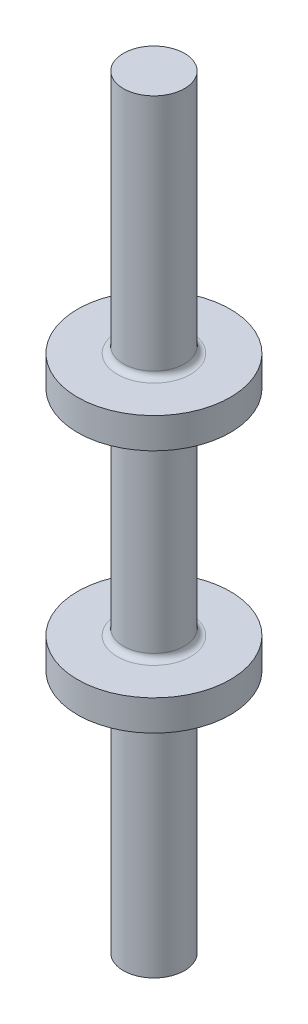
ISO-10303-21;
HEADER;
FILE_DESCRIPTION(('STEP AP214'),'2;1');
FILE_NAME('part.step','',(''),(''),'','','');
FILE_SCHEMA(('AUTOMOTIVE_DESIGN { 1 0 10303 214 1 1 1 1 }'));
ENDSEC;
DATA;
#1=APPLICATION_CONTEXT('core data for automotive mechanical design processes');
#2=APPLICATION_PROTOCOL_DEFINITION('international standard','automotive_design',2000,#1);
#3=PRODUCT_CONTEXT('',#1,'mechanical');
#4=PRODUCT('Part','Part','',(#3));
#5=PRODUCT_RELATED_PRODUCT_CATEGORY('part','',(#4));
#6=PRODUCT_DEFINITION_FORMATION('','',#4);
#7=PRODUCT_DEFINITION_CONTEXT('part definition',#1,'design');
#8=PRODUCT_DEFINITION('design','',#6,#7);
#9=PRODUCT_DEFINITION_SHAPE('','',#8);
#10=(LENGTH_UNIT() NAMED_UNIT(*) SI_UNIT(.MILLI.,.METRE.));
#11=(NAMED_UNIT(*) PLANE_ANGLE_UNIT() SI_UNIT($,.RADIAN.));
#12=(NAMED_UNIT(*) SI_UNIT($,.STERADIAN.) SOLID_ANGLE_UNIT());
#13=UNCERTAINTY_MEASURE_WITH_UNIT(LENGTH_MEASURE(1.E-05),#10,'distance_accuracy_value','');
#14=(GEOMETRIC_REPRESENTATION_CONTEXT(3) GLOBAL_UNCERTAINTY_ASSIGNED_CONTEXT((#13)) GLOBAL_UNIT_ASSIGNED_CONTEXT((#10,
#11,#12)) REPRESENTATION_CONTEXT('',''));
#15=CARTESIAN_POINT('',(0.,0.,0.));
#16=DIRECTION('',(0.,0.,1.));
#17=DIRECTION('',(1.,0.,0.));
#18=AXIS2_PLACEMENT_3D('',#15,#16,#17);
#19=CARTESIAN_POINT('',(0.,0.,0.));
#20=DIRECTION('',(0.,1.,0.));
#21=DIRECTION('',(0.,0.,1.));
#22=AXIS2_PLACEMENT_3D('',#19,#20,#21);
#23=PLANE('',#22);
#24=CARTESIAN_POINT('',(0.,0.,0.));
#25=DIRECTION('',(0.,1.,0.));
#26=DIRECTION('',(0.,0.,1.));
#27=AXIS2_PLACEMENT_3D('',#24,#25,#26);
#28=CIRCLE('',#27,1.);
#29=CARTESIAN_POINT('',(0.,0.,1.));
#30=VERTEX_POINT('',#29);
#31=EDGE_CURVE('E80',#30,#30,#28,.T.);
#32=ORIENTED_EDGE('',*,*,#31,.F.);
#33=EDGE_LOOP('',(#32));
#34=FACE_BOUND('',#33,.T.);
#35=ADVANCED_FACE('F38',(#34),#23,.F.);
#36=CARTESIAN_POINT('',(0.,25.,0.));
#37=DIRECTION('',(0.,1.,0.));
#38=DIRECTION('',(0.,0.,1.));
#39=AXIS2_PLACEMENT_3D('',#36,#37,#38);
#40=CYLINDRICAL_SURFACE('',#39,1.);
#41=CARTESIAN_POINT('',(0.,7.8,0.));
#42=DIRECTION('',(0.,1.,0.));
#43=DIRECTION('',(0.,0.,1.));
#44=AXIS2_PLACEMENT_3D('',#41,#42,#43);
#45=CIRCLE('',#44,1.);
#46=CARTESIAN_POINT('',(0.,7.8,1.));
#47=VERTEX_POINT('',#46);
#48=EDGE_CURVE('E72',#47,#47,#45,.F.);
#49=ORIENTED_EDGE('',*,*,#48,.T.);
#50=EDGE_LOOP('',(#49));
#51=FACE_BOUND('',#50,.T.);
#52=ORIENTED_EDGE('',*,*,#31,.T.);
#53=EDGE_LOOP('',(#52));
#54=FACE_BOUND('',#53,.T.);
#55=ADVANCED_FACE('F121',(#51,#54),#40,.T.);
#56=CARTESIAN_POINT('',(1.,8.,0.));
#57=DIRECTION('',(0.,1.,0.));
#58=DIRECTION('',(0.,0.,1.));
#59=AXIS2_PLACEMENT_3D('',#56,#57,#58);
#60=PLANE('',#59);
#61=CARTESIAN_POINT('',(0.,8.,0.));
#62=DIRECTION('',(0.,1.,0.));
#63=DIRECTION('',(0.,0.,1.));
#64=AXIS2_PLACEMENT_3D('',#61,#62,#63);
#65=CIRCLE('',#64,1.2);
#66=CARTESIAN_POINT('',(0.,8.,1.2));
#67=VERTEX_POINT('',#66);
#68=EDGE_CURVE('E76',#67,#67,#65,.T.);
#69=ORIENTED_EDGE('',*,*,#68,.T.);
#70=EDGE_LOOP('',(#69));
#71=FACE_BOUND('',#70,.T.);
#72=CARTESIAN_POINT('',(0.,8.,0.));
#73=DIRECTION('',(0.,1.,0.));
#74=DIRECTION('',(0.,0.,1.));
#75=AXIS2_PLACEMENT_3D('',#72,#73,#74);
#76=CIRCLE('',#75,2.5);
#77=CARTESIAN_POINT('',(0.,8.,2.5));
#78=VERTEX_POINT('',#77);
#79=EDGE_CURVE('E84',#78,#78,#76,.T.);
#80=ORIENTED_EDGE('',*,*,#79,.F.);
#81=EDGE_LOOP('',(#80));
#82=FACE_BOUND('',#81,.T.);
#83=ADVANCED_FACE('F127',(#71,#82),#60,.F.);
#84=CARTESIAN_POINT('',(0.,25.,0.));
#85=DIRECTION('',(0.,1.,0.));
#86=DIRECTION('',(0.,0.,1.));
#87=AXIS2_PLACEMENT_3D('',#84,#85,#86);
#88=CYLINDRICAL_SURFACE('',#87,2.5);
#89=CARTESIAN_POINT('',(0.,9.,0.));
#90=DIRECTION('',(0.,1.,0.));
#91=DIRECTION('',(0.,0.,1.));
#92=AXIS2_PLACEMENT_3D('',#89,#90,#91);
#93=CIRCLE('',#92,2.5);
#94=CARTESIAN_POINT('',(0.,9.,2.5));
#95=VERTEX_POINT('',#94);
#96=EDGE_CURVE('E88',#95,#95,#93,.T.);
#97=ORIENTED_EDGE('',*,*,#96,.F.);
#98=EDGE_LOOP('',(#97));
#99=FACE_BOUND('',#98,.T.);
#100=ORIENTED_EDGE('',*,*,#79,.T.);
#101=EDGE_LOOP('',(#100));
#102=FACE_BOUND('',#101,.T.);
#103=ADVANCED_FACE('F170',(#99,#102),#88,.T.);
#104=CARTESIAN_POINT('',(2.5,9.,0.));
#105=DIRECTION('',(0.,-1.,0.));
#106=DIRECTION('',(0.,0.,-1.));
#107=AXIS2_PLACEMENT_3D('',#104,#105,#106);
#108=PLANE('',#107);
#109=CARTESIAN_POINT('',(0.,9.,0.));
#110=DIRECTION('',(0.,-1.,0.));
#111=DIRECTION('',(0.,0.,-1.));
#112=AXIS2_PLACEMENT_3D('',#109,#110,#111);
#113=CIRCLE('',#112,1.2);
#114=CARTESIAN_POINT('',(0.,9.,-1.2));
#115=VERTEX_POINT('',#114);
#116=EDGE_CURVE('E58',#115,#115,#113,.T.);
#117=ORIENTED_EDGE('',*,*,#116,.T.);
#118=EDGE_LOOP('',(#117));
#119=FACE_BOUND('',#118,.T.);
#120=ORIENTED_EDGE('',*,*,#96,.T.);
#121=EDGE_LOOP('',(#120));
#122=FACE_BOUND('',#121,.T.);
#123=ADVANCED_FACE('F166',(#119,#122),#108,.F.);
#124=CARTESIAN_POINT('',(0.,25.,0.));
#125=DIRECTION('',(0.,1.,0.));
#126=DIRECTION('',(0.,0.,1.));
#127=AXIS2_PLACEMENT_3D('',#124,#125,#126);
#128=CYLINDRICAL_SURFACE('',#127,1.);
#129=CARTESIAN_POINT('',(0.,9.2,0.));
#130=DIRECTION('',(0.,-1.,0.));
#131=DIRECTION('',(0.,0.,-1.));
#132=AXIS2_PLACEMENT_3D('',#129,#130,#131);
#133=CIRCLE('',#132,1.);
#134=CARTESIAN_POINT('',(0.,9.2,-1.));
#135=VERTEX_POINT('',#134);
#136=EDGE_CURVE('E64',#135,#135,#133,.F.);
#137=ORIENTED_EDGE('',*,*,#136,.T.);
#138=EDGE_LOOP('',(#137));
#139=FACE_BOUND('',#138,.T.);
#140=CARTESIAN_POINT('',(0.,15.8,0.));
#141=DIRECTION('',(0.,1.,0.));
#142=DIRECTION('',(0.,0.,1.));
#143=AXIS2_PLACEMENT_3D('',#140,#141,#142);
#144=CIRCLE('',#143,1.);
#145=CARTESIAN_POINT('',(0.,15.8,1.));
#146=VERTEX_POINT('',#145);
#147=EDGE_CURVE('E68',#146,#146,#144,.F.);
#148=ORIENTED_EDGE('',*,*,#147,.T.);
#149=EDGE_LOOP('',(#148));
#150=FACE_BOUND('',#149,.T.);
#151=ADVANCED_FACE('F153',(#139,#150),#128,.T.);
#152=CARTESIAN_POINT('',(1.,16.,0.));
#153=DIRECTION('',(0.,1.,0.));
#154=DIRECTION('',(0.,0.,1.));
#155=AXIS2_PLACEMENT_3D('',#152,#153,#154);
#156=PLANE('',#155);
#157=CARTESIAN_POINT('',(0.,16.,0.));
#158=DIRECTION('',(0.,1.,0.));
#159=DIRECTION('',(0.,0.,1.));
#160=AXIS2_PLACEMENT_3D('',#157,#158,#159);
#161=CIRCLE('',#160,1.2);
#162=CARTESIAN_POINT('',(0.,16.,1.2));
#163=VERTEX_POINT('',#162);
#164=EDGE_CURVE('E52',#163,#163,#161,.T.);
#165=ORIENTED_EDGE('',*,*,#164,.T.);
#166=EDGE_LOOP('',(#165));
#167=FACE_BOUND('',#166,.T.);
#168=CARTESIAN_POINT('',(0.,16.,0.));
#169=DIRECTION('',(0.,1.,0.));
#170=DIRECTION('',(0.,0.,1.));
#171=AXIS2_PLACEMENT_3D('',#168,#169,#170);
#172=CIRCLE('',#171,2.5);
#173=CARTESIAN_POINT('',(0.,16.,2.5));
#174=VERTEX_POINT('',#173);
#175=EDGE_CURVE('E92',#174,#174,#172,.T.);
#176=ORIENTED_EDGE('',*,*,#175,.F.);
#177=EDGE_LOOP('',(#176));
#178=FACE_BOUND('',#177,.T.);
#179=ADVANCED_FACE('F150',(#167,#178),#156,.F.);
#180=CARTESIAN_POINT('',(0.,25.,0.));
#181=DIRECTION('',(0.,1.,0.));
#182=DIRECTION('',(0.,0.,1.));
#183=AXIS2_PLACEMENT_3D('',#180,#181,#182);
#184=CYLINDRICAL_SURFACE('',#183,2.5);
#185=CARTESIAN_POINT('',(0.,17.,0.));
#186=DIRECTION('',(0.,1.,0.));
#187=DIRECTION('',(0.,0.,1.));
#188=AXIS2_PLACEMENT_3D('',#185,#186,#187);
#189=CIRCLE('',#188,2.5);
#190=CARTESIAN_POINT('',(0.,17.,2.5));
#191=VERTEX_POINT('',#190);
#192=EDGE_CURVE('E96',#191,#191,#189,.T.);
#193=ORIENTED_EDGE('',*,*,#192,.F.);
#194=EDGE_LOOP('',(#193));
#195=FACE_BOUND('',#194,.T.);
#196=ORIENTED_EDGE('',*,*,#175,.T.);
#197=EDGE_LOOP('',(#196));
#198=FACE_BOUND('',#197,.T.);
#199=ADVANCED_FACE('F118',(#195,#198),#184,.T.);
#200=CARTESIAN_POINT('',(2.5,17.,0.));
#201=DIRECTION('',(0.,-1.,0.));
#202=DIRECTION('',(0.,0.,-1.));
#203=AXIS2_PLACEMENT_3D('',#200,#201,#202);
#204=PLANE('',#203);
#205=CARTESIAN_POINT('',(0.,17.,0.));
#206=DIRECTION('',(0.,-1.,0.));
#207=DIRECTION('',(0.,0.,-1.));
#208=AXIS2_PLACEMENT_3D('',#205,#206,#207);
#209=CIRCLE('',#208,1.2);
#210=CARTESIAN_POINT('',(0.,17.,-1.2));
#211=VERTEX_POINT('',#210);
#212=EDGE_CURVE('E10',#211,#211,#209,.T.);
#213=ORIENTED_EDGE('',*,*,#212,.T.);
#214=EDGE_LOOP('',(#213));
#215=FACE_BOUND('',#214,.T.);
#216=ORIENTED_EDGE('',*,*,#192,.T.);
#217=EDGE_LOOP('',(#216));
#218=FACE_BOUND('',#217,.T.);
#219=ADVANCED_FACE('F110',(#215,#218),#204,.F.);
#220=CARTESIAN_POINT('',(0.,25.,0.));
#221=DIRECTION('',(0.,1.,0.));
#222=DIRECTION('',(0.,0.,1.));
#223=AXIS2_PLACEMENT_3D('',#220,#221,#222);
#224=CYLINDRICAL_SURFACE('',#223,1.);
#225=CARTESIAN_POINT('',(0.,17.2,0.));
#226=DIRECTION('',(0.,-1.,0.));
#227=DIRECTION('',(0.,0.,-1.));
#228=AXIS2_PLACEMENT_3D('',#225,#226,#227);
#229=CIRCLE('',#228,1.);
#230=CARTESIAN_POINT('',(0.,17.2,-1.));
#231=VERTEX_POINT('',#230);
#232=EDGE_CURVE('E46',#231,#231,#229,.F.);
#233=ORIENTED_EDGE('',*,*,#232,.T.);
#234=EDGE_LOOP('',(#233));
#235=FACE_BOUND('',#234,.T.);
#236=CARTESIAN_POINT('',(0.,25.,0.));
#237=DIRECTION('',(0.,1.,0.));
#238=DIRECTION('',(0.,0.,1.));
#239=AXIS2_PLACEMENT_3D('',#236,#237,#238);
#240=CIRCLE('',#239,1.);
#241=CARTESIAN_POINT('',(0.,25.,1.));
#242=VERTEX_POINT('',#241);
#243=EDGE_CURVE('E100',#242,#242,#240,.T.);
#244=ORIENTED_EDGE('',*,*,#243,.F.);
#245=EDGE_LOOP('',(#244));
#246=FACE_BOUND('',#245,.T.);
#247=ADVANCED_FACE('F108',(#235,#246),#224,.T.);
#248=CARTESIAN_POINT('',(1.,25.,0.));
#249=DIRECTION('',(0.,-1.,0.));
#250=DIRECTION('',(0.,0.,-1.));
#251=AXIS2_PLACEMENT_3D('',#248,#249,#250);
#252=PLANE('',#251);
#253=ORIENTED_EDGE('',*,*,#243,.T.);
#254=EDGE_LOOP('',(#253));
#255=FACE_BOUND('',#254,.T.);
#256=ADVANCED_FACE('F106',(#255),#252,.F.);
#257=CARTESIAN_POINT('',(0.,7.8,0.));
#258=DIRECTION('',(0.,1.,0.));
#259=DIRECTION('',(0.,0.,1.));
#260=AXIS2_PLACEMENT_3D('',#257,#258,#259);
#261=TOROIDAL_SURFACE('',#260,1.2,0.2);
#262=ORIENTED_EDGE('',*,*,#48,.F.);
#263=EDGE_LOOP('',(#262));
#264=FACE_BOUND('',#263,.T.);
#265=ORIENTED_EDGE('',*,*,#68,.F.);
#266=EDGE_LOOP('',(#265));
#267=FACE_BOUND('',#266,.T.);
#268=ADVANCED_FACE('F116',(#264,#267),#261,.F.);
#269=CARTESIAN_POINT('',(0.,9.2,0.));
#270=DIRECTION('',(0.,-1.,0.));
#271=DIRECTION('',(0.,0.,-1.));
#272=AXIS2_PLACEMENT_3D('',#269,#270,#271);
#273=TOROIDAL_SURFACE('',#272,1.2,0.2);
#274=ORIENTED_EDGE('',*,*,#116,.F.);
#275=EDGE_LOOP('',(#274));
#276=FACE_BOUND('',#275,.T.);
#277=ORIENTED_EDGE('',*,*,#136,.F.);
#278=EDGE_LOOP('',(#277));
#279=FACE_BOUND('',#278,.T.);
#280=ADVANCED_FACE('F135',(#276,#279),#273,.F.);
#281=CARTESIAN_POINT('',(0.,15.8,0.));
#282=DIRECTION('',(0.,1.,0.));
#283=DIRECTION('',(0.,0.,1.));
#284=AXIS2_PLACEMENT_3D('',#281,#282,#283);
#285=TOROIDAL_SURFACE('',#284,1.2,0.2);
#286=ORIENTED_EDGE('',*,*,#147,.F.);
#287=EDGE_LOOP('',(#286));
#288=FACE_BOUND('',#287,.T.);
#289=ORIENTED_EDGE('',*,*,#164,.F.);
#290=EDGE_LOOP('',(#289));
#291=FACE_BOUND('',#290,.T.);
#292=ADVANCED_FACE('F138',(#288,#291),#285,.F.);
#293=CARTESIAN_POINT('',(0.,17.2,0.));
#294=DIRECTION('',(0.,-1.,0.));
#295=DIRECTION('',(0.,0.,-1.));
#296=AXIS2_PLACEMENT_3D('',#293,#294,#295);
#297=TOROIDAL_SURFACE('',#296,1.2,0.2);
#298=ORIENTED_EDGE('',*,*,#212,.F.);
#299=EDGE_LOOP('',(#298));
#300=FACE_BOUND('',#299,.T.);
#301=ORIENTED_EDGE('',*,*,#232,.F.);
#302=EDGE_LOOP('',(#301));
#303=FACE_BOUND('',#302,.T.);
#304=ADVANCED_FACE('F40',(#300,#303),#297,.F.);
#305=CLOSED_SHELL('',(#35,#55,#83,#103,#123,#151,#179,#199,#219,#247,#256,#268,#280,#292,#304));
#306=MANIFOLD_SOLID_BREP('B2',#305);
#307=ADVANCED_BREP_SHAPE_REPRESENTATION('',(#18,#306),#14);
#308=SHAPE_DEFINITION_REPRESENTATION(#9,#307);
ENDSEC;
END-ISO-10303-21;
